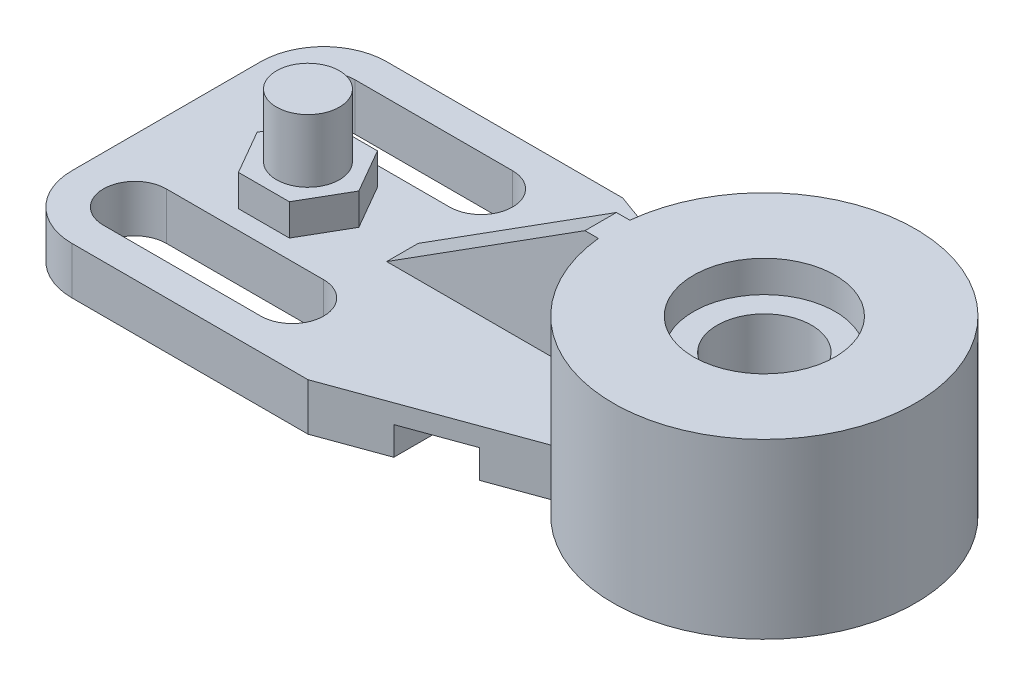
ISO-10303-21;
HEADER;
FILE_DESCRIPTION(('STEP AP214'),'2;1');
FILE_NAME('part.step','',(''),(''),'','','');
FILE_SCHEMA(('AUTOMOTIVE_DESIGN { 1 0 10303 214 1 1 1 1 }'));
ENDSEC;
DATA;
#1=APPLICATION_CONTEXT('core data for automotive mechanical design processes');
#2=APPLICATION_PROTOCOL_DEFINITION('international standard','automotive_design',2000,#1);
#3=PRODUCT_CONTEXT('',#1,'mechanical');
#4=PRODUCT('Part','Part','',(#3));
#5=PRODUCT_RELATED_PRODUCT_CATEGORY('part','',(#4));
#6=PRODUCT_DEFINITION_FORMATION('','',#4);
#7=PRODUCT_DEFINITION_CONTEXT('part definition',#1,'design');
#8=PRODUCT_DEFINITION('design','',#6,#7);
#9=PRODUCT_DEFINITION_SHAPE('','',#8);
#10=(LENGTH_UNIT() NAMED_UNIT(*) SI_UNIT(.MILLI.,.METRE.));
#11=(NAMED_UNIT(*) PLANE_ANGLE_UNIT() SI_UNIT($,.RADIAN.));
#12=(NAMED_UNIT(*) SI_UNIT($,.STERADIAN.) SOLID_ANGLE_UNIT());
#13=UNCERTAINTY_MEASURE_WITH_UNIT(LENGTH_MEASURE(1.E-05),#10,'distance_accuracy_value','');
#14=(GEOMETRIC_REPRESENTATION_CONTEXT(3) GLOBAL_UNCERTAINTY_ASSIGNED_CONTEXT((#13)) GLOBAL_UNIT_ASSIGNED_CONTEXT((#10,
#11,#12)) REPRESENTATION_CONTEXT('',''));
#15=CARTESIAN_POINT('',(0.,0.,0.));
#16=DIRECTION('',(0.,0.,1.));
#17=DIRECTION('',(1.,0.,0.));
#18=AXIS2_PLACEMENT_3D('',#15,#16,#17);
#19=CARTESIAN_POINT('',(0.,9.525,31.75));
#20=DIRECTION('',(0.,-1.,0.));
#21=DIRECTION('',(1.,0.,0.));
#22=AXIS2_PLACEMENT_3D('',#19,#20,#21);
#23=PLANE('',#22);
#24=DIRECTION('',(1.,0.,0.));
#25=VECTOR('',#24,1.);
#26=CARTESIAN_POINT('',(-107.95,9.52499999999999,25.4));
#27=LINE('',#26,#25);
#28=CARTESIAN_POINT('',(-107.95,9.52499999999999,25.4));
#29=VERTEX_POINT('',#28);
#30=CARTESIAN_POINT('',(-76.2,9.52499999999999,25.4));
#31=VERTEX_POINT('',#30);
#32=EDGE_CURVE('E382',#29,#31,#27,.T.);
#33=ORIENTED_EDGE('',*,*,#32,.F.);
#34=CARTESIAN_POINT('',(-107.95,9.52499999999999,19.05));
#35=DIRECTION('',(0.,1.,0.));
#36=DIRECTION('',(1.,0.,0.));
#37=AXIS2_PLACEMENT_3D('',#34,#35,#36);
#38=CIRCLE('',#37,6.35);
#39=CARTESIAN_POINT('',(-107.95,9.52499999999999,12.7));
#40=VERTEX_POINT('',#39);
#41=EDGE_CURVE('E349',#40,#29,#38,.T.);
#42=ORIENTED_EDGE('',*,*,#41,.F.);
#43=DIRECTION('',(-1.,0.,0.));
#44=VECTOR('',#43,1.);
#45=CARTESIAN_POINT('',(-107.95,9.52499999999999,12.7));
#46=LINE('',#45,#44);
#47=CARTESIAN_POINT('',(-76.2,9.52499999999999,12.7));
#48=VERTEX_POINT('',#47);
#49=EDGE_CURVE('E371',#48,#40,#46,.T.);
#50=ORIENTED_EDGE('',*,*,#49,.F.);
#51=CARTESIAN_POINT('',(-76.2,9.52499999999999,19.05));
#52=DIRECTION('',(0.,1.,0.));
#53=DIRECTION('',(1.,0.,0.));
#54=AXIS2_PLACEMENT_3D('',#51,#52,#53);
#55=CIRCLE('',#54,6.35);
#56=EDGE_CURVE('E379',#31,#48,#55,.T.);
#57=ORIENTED_EDGE('',*,*,#56,.F.);
#58=EDGE_LOOP('',(#33,#42,#50,#57));
#59=FACE_BOUND('',#58,.T.);
#60=DIRECTION('',(1.,0.,0.));
#61=VECTOR('',#60,1.);
#62=CARTESIAN_POINT('',(-107.95,9.52499999999999,-12.7));
#63=LINE('',#62,#61);
#64=CARTESIAN_POINT('',(-107.95,9.52499999999999,-12.7));
#65=VERTEX_POINT('',#64);
#66=CARTESIAN_POINT('',(-76.2,9.52499999999999,-12.7));
#67=VERTEX_POINT('',#66);
#68=EDGE_CURVE('E348',#65,#67,#63,.T.);
#69=ORIENTED_EDGE('',*,*,#68,.F.);
#70=CARTESIAN_POINT('',(-107.95,9.52499999999999,-19.05));
#71=DIRECTION('',(0.,1.,0.));
#72=DIRECTION('',(-1.,0.,0.));
#73=AXIS2_PLACEMENT_3D('',#70,#71,#72);
#74=CIRCLE('',#73,6.35);
#75=CARTESIAN_POINT('',(-107.95,9.52499999999999,-25.4));
#76=VERTEX_POINT('',#75);
#77=EDGE_CURVE('E346',#76,#65,#74,.T.);
#78=ORIENTED_EDGE('',*,*,#77,.F.);
#79=DIRECTION('',(-1.,0.,0.));
#80=VECTOR('',#79,1.);
#81=CARTESIAN_POINT('',(-107.95,9.52499999999999,-25.4));
#82=LINE('',#81,#80);
#83=CARTESIAN_POINT('',(-76.2,9.52499999999999,-25.4));
#84=VERTEX_POINT('',#83);
#85=EDGE_CURVE('E355',#84,#76,#82,.T.);
#86=ORIENTED_EDGE('',*,*,#85,.F.);
#87=CARTESIAN_POINT('',(-76.2,9.52499999999999,-19.05));
#88=DIRECTION('',(0.,1.,0.));
#89=DIRECTION('',(-1.,0.,0.));
#90=AXIS2_PLACEMENT_3D('',#87,#88,#89);
#91=CIRCLE('',#90,6.35);
#92=EDGE_CURVE('E352',#67,#84,#91,.T.);
#93=ORIENTED_EDGE('',*,*,#92,.F.);
#94=EDGE_LOOP('',(#69,#78,#86,#93));
#95=FACE_BOUND('',#94,.T.);
#96=CARTESIAN_POINT('',(0.,9.525,0.));
#97=DIRECTION('',(0.,-1.,0.));
#98=DIRECTION('',(1.,0.,0.));
#99=AXIS2_PLACEMENT_3D('',#96,#97,#98);
#100=CIRCLE('',#99,30.48);
#101=CARTESIAN_POINT('',(-30.3141843861912,9.525,3.175));
#102=VERTEX_POINT('',#101);
#103=CARTESIAN_POINT('',(-24.1575361709896,9.525,18.5861197173409));
#104=VERTEX_POINT('',#103);
#105=EDGE_CURVE('E456',#102,#104,#100,.F.);
#106=ORIENTED_EDGE('',*,*,#105,.F.);
#107=DIRECTION('',(1.,0.,0.));
#108=VECTOR('',#107,1.);
#109=CARTESIAN_POINT('',(-28.575,9.52499999999999,3.175));
#110=LINE('',#109,#108);
#111=CARTESIAN_POINT('',(-73.025,9.52499999999999,3.175));
#112=VERTEX_POINT('',#111);
#113=EDGE_CURVE('E268',#112,#102,#110,.T.);
#114=ORIENTED_EDGE('',*,*,#113,.F.);
#115=DIRECTION('',(0.,0.,-1.));
#116=VECTOR('',#115,1.);
#117=CARTESIAN_POINT('',(-73.025,9.52499999999999,3.175));
#118=LINE('',#117,#116);
#119=CARTESIAN_POINT('',(-73.025,9.52499999999999,-3.175));
#120=VERTEX_POINT('',#119);
#121=EDGE_CURVE('E276',#112,#120,#118,.T.);
#122=ORIENTED_EDGE('',*,*,#121,.T.);
#123=DIRECTION('',(1.,0.,0.));
#124=VECTOR('',#123,1.);
#125=CARTESIAN_POINT('',(-28.575,9.52499999999999,-3.175));
#126=LINE('',#125,#124);
#127=CARTESIAN_POINT('',(-30.3141843861912,9.52499999999999,-3.175));
#128=VERTEX_POINT('',#127);
#129=EDGE_CURVE('E259',#120,#128,#126,.T.);
#130=ORIENTED_EDGE('',*,*,#129,.T.);
#131=CARTESIAN_POINT('',(-24.1575361709896,9.525,-18.5861197173409));
#132=VERTEX_POINT('',#131);
#133=EDGE_CURVE('E48',#132,#128,#100,.F.);
#134=ORIENTED_EDGE('',*,*,#133,.F.);
#135=DIRECTION('',(0.939692620785911,0.,0.342020143325663));
#136=VECTOR('',#135,1.);
#137=CARTESIAN_POINT('',(-60.325,9.52499999999999,-31.75));
#138=LINE('',#137,#136);
#139=CARTESIAN_POINT('',(-60.325,9.52499999999999,-31.75));
#140=VERTEX_POINT('',#139);
#141=EDGE_CURVE('E296',#140,#132,#138,.T.);
#142=ORIENTED_EDGE('',*,*,#141,.F.);
#143=DIRECTION('',(-1.,0.,0.));
#144=VECTOR('',#143,1.);
#145=CARTESIAN_POINT('',(0.,9.525,-31.75));
#146=LINE('',#145,#144);
#147=CARTESIAN_POINT('',(-107.95,9.52499999999999,-31.75));
#148=VERTEX_POINT('',#147);
#149=EDGE_CURVE('E361',#140,#148,#146,.T.);
#150=ORIENTED_EDGE('',*,*,#149,.T.);
#151=CARTESIAN_POINT('',(-107.95,9.52499999999999,-19.05));
#152=DIRECTION('',(0.,-1.,0.));
#153=DIRECTION('',(1.,0.,0.));
#154=AXIS2_PLACEMENT_3D('',#151,#152,#153);
#155=CIRCLE('',#154,12.7);
#156=CARTESIAN_POINT('',(-120.65,9.52499999999998,-19.05));
#157=VERTEX_POINT('',#156);
#158=EDGE_CURVE('E428',#148,#157,#155,.F.);
#159=ORIENTED_EDGE('',*,*,#158,.T.);
#160=DIRECTION('',(0.,0.,-1.));
#161=VECTOR('',#160,1.);
#162=CARTESIAN_POINT('',(-120.65,9.52499999999998,31.75));
#163=LINE('',#162,#161);
#164=CARTESIAN_POINT('',(-120.65,9.52499999999998,19.05));
#165=VERTEX_POINT('',#164);
#166=EDGE_CURVE('E410',#165,#157,#163,.T.);
#167=ORIENTED_EDGE('',*,*,#166,.F.);
#168=CARTESIAN_POINT('',(-107.95,9.52499999999999,19.05));
#169=DIRECTION('',(0.,-1.,0.));
#170=DIRECTION('',(1.,0.,0.));
#171=AXIS2_PLACEMENT_3D('',#168,#169,#170);
#172=CIRCLE('',#171,12.7);
#173=CARTESIAN_POINT('',(-107.95,9.52499999999999,31.75));
#174=VERTEX_POINT('',#173);
#175=EDGE_CURVE('E425',#165,#174,#172,.F.);
#176=ORIENTED_EDGE('',*,*,#175,.T.);
#177=DIRECTION('',(-1.,0.,0.));
#178=VECTOR('',#177,1.);
#179=CARTESIAN_POINT('',(0.,9.525,31.75));
#180=LINE('',#179,#178);
#181=CARTESIAN_POINT('',(-60.325,9.52499999999999,31.75));
#182=VERTEX_POINT('',#181);
#183=EDGE_CURVE('E386',#182,#174,#180,.T.);
#184=ORIENTED_EDGE('',*,*,#183,.F.);
#185=DIRECTION('',(-0.939692620785911,0.,0.342020143325663));
#186=VECTOR('',#185,1.);
#187=CARTESIAN_POINT('',(-60.325,9.52499999999999,31.75));
#188=LINE('',#187,#186);
#189=EDGE_CURVE('E298',#104,#182,#188,.T.);
#190=ORIENTED_EDGE('',*,*,#189,.F.);
#191=EDGE_LOOP('',(#106,#114,#122,#130,#134,#142,#150,#159,#167,#176,#184,#190));
#192=FACE_BOUND('',#191,.T.);
#193=DIRECTION('',(0.5,0.,-0.866025403784438));
#194=VECTOR('',#193,1.);
#195=CARTESIAN_POINT('',(-86.9423561069042,9.52499999999999,8.89));
#196=LINE('',#195,#194);
#197=CARTESIAN_POINT('',(-86.9423561069042,9.52499999999999,8.89));
#198=VERTEX_POINT('',#197);
#199=CARTESIAN_POINT('',(-81.8097122138085,9.52499999999999,0.));
#200=VERTEX_POINT('',#199);
#201=EDGE_CURVE('E258',#198,#200,#196,.T.);
#202=ORIENTED_EDGE('',*,*,#201,.F.);
#203=DIRECTION('',(1.,0.,0.));
#204=VECTOR('',#203,1.);
#205=CARTESIAN_POINT('',(-97.2076438930958,9.52499999999999,8.89));
#206=LINE('',#205,#204);
#207=CARTESIAN_POINT('',(-97.2076438930958,9.52499999999999,8.89));
#208=VERTEX_POINT('',#207);
#209=EDGE_CURVE('E255',#208,#198,#206,.T.);
#210=ORIENTED_EDGE('',*,*,#209,.F.);
#211=DIRECTION('',(0.5,0.,0.866025403784439));
#212=VECTOR('',#211,1.);
#213=CARTESIAN_POINT('',(-102.340287786192,9.52499999999999,0.));
#214=LINE('',#213,#212);
#215=CARTESIAN_POINT('',(-102.340287786192,9.52499999999999,0.));
#216=VERTEX_POINT('',#215);
#217=EDGE_CURVE('E805',#216,#208,#214,.T.);
#218=ORIENTED_EDGE('',*,*,#217,.F.);
#219=DIRECTION('',(-0.5,0.,0.866025403784439));
#220=VECTOR('',#219,1.);
#221=CARTESIAN_POINT('',(-97.2076438930958,9.52499999999999,-8.89));
#222=LINE('',#221,#220);
#223=CARTESIAN_POINT('',(-97.2076438930958,9.52499999999999,-8.89));
#224=VERTEX_POINT('',#223);
#225=EDGE_CURVE('E802',#224,#216,#222,.T.);
#226=ORIENTED_EDGE('',*,*,#225,.F.);
#227=DIRECTION('',(-1.,0.,0.));
#228=VECTOR('',#227,1.);
#229=CARTESIAN_POINT('',(-86.9423561069042,9.52499999999999,-8.89));
#230=LINE('',#229,#228);
#231=CARTESIAN_POINT('',(-86.9423561069042,9.52499999999999,-8.88999999999999));
#232=VERTEX_POINT('',#231);
#233=EDGE_CURVE('E61',#232,#224,#230,.T.);
#234=ORIENTED_EDGE('',*,*,#233,.F.);
#235=DIRECTION('',(-0.5,0.,-0.866025403784438));
#236=VECTOR('',#235,1.);
#237=CARTESIAN_POINT('',(-81.8097122138085,9.52499999999999,0.));
#238=LINE('',#237,#236);
#239=EDGE_CURVE('E56',#200,#232,#238,.T.);
#240=ORIENTED_EDGE('',*,*,#239,.F.);
#241=EDGE_LOOP('',(#202,#210,#218,#226,#234,#240));
#242=FACE_BOUND('',#241,.T.);
#243=ADVANCED_FACE('F39',(#59,#95,#192,#242),#23,.F.);
#244=CARTESIAN_POINT('',(0.,0.,0.));
#245=DIRECTION('',(0.,1.,0.));
#246=DIRECTION('',(0.,0.,1.));
#247=AXIS2_PLACEMENT_3D('',#244,#245,#246);
#248=CYLINDRICAL_SURFACE('',#247,9.525);
#249=CARTESIAN_POINT('',(0.,0.,0.));
#250=DIRECTION('',(0.,1.,0.));
#251=DIRECTION('',(0.,0.,1.));
#252=AXIS2_PLACEMENT_3D('',#249,#250,#251);
#253=CIRCLE('',#252,9.525);
#254=CARTESIAN_POINT('',(0.,0.,9.525));
#255=VERTEX_POINT('',#254);
#256=EDGE_CURVE('E337',#255,#255,#253,.T.);
#257=ORIENTED_EDGE('',*,*,#256,.F.);
#258=EDGE_LOOP('',(#257));
#259=FACE_BOUND('',#258,.T.);
#260=CARTESIAN_POINT('',(0.,28.575,0.));
#261=DIRECTION('',(0.,1.,0.));
#262=DIRECTION('',(0.,0.,1.));
#263=AXIS2_PLACEMENT_3D('',#260,#261,#262);
#264=CIRCLE('',#263,9.525);
#265=CARTESIAN_POINT('',(0.,28.575,9.525));
#266=VERTEX_POINT('',#265);
#267=EDGE_CURVE('E43',#266,#266,#264,.F.);
#268=ORIENTED_EDGE('',*,*,#267,.F.);
#269=EDGE_LOOP('',(#268));
#270=FACE_BOUND('',#269,.T.);
#271=ADVANCED_FACE('F520',(#259,#270),#248,.F.);
#272=CARTESIAN_POINT('',(-34.925,0.,31.75));
#273=DIRECTION('',(0.,1.,0.));
#274=DIRECTION('',(0.,0.,1.));
#275=AXIS2_PLACEMENT_3D('',#272,#273,#274);
#276=PLANE('',#275);
#277=ORIENTED_EDGE('',*,*,#256,.T.);
#278=EDGE_LOOP('',(#277));
#279=FACE_BOUND('',#278,.T.);
#280=DIRECTION('',(0.939692620785911,0.,0.342020143325663));
#281=VECTOR('',#280,1.);
#282=CARTESIAN_POINT('',(-60.325,0.,-31.75));
#283=LINE('',#282,#281);
#284=CARTESIAN_POINT('',(-34.925,0.,-22.5051560496386));
#285=VERTEX_POINT('',#284);
#286=CARTESIAN_POINT('',(-24.1575361709896,0.,-18.5861197173409));
#287=VERTEX_POINT('',#286);
#288=EDGE_CURVE('E295',#285,#287,#283,.T.);
#289=ORIENTED_EDGE('',*,*,#288,.T.);
#290=CARTESIAN_POINT('',(0.,0.,0.));
#291=DIRECTION('',(0.,1.,0.));
#292=DIRECTION('',(0.,0.,1.));
#293=AXIS2_PLACEMENT_3D('',#290,#291,#292);
#294=CIRCLE('',#293,30.48);
#295=CARTESIAN_POINT('',(-24.1575361709896,0.,18.5861197173409));
#296=VERTEX_POINT('',#295);
#297=EDGE_CURVE('E340',#296,#287,#294,.T.);
#298=ORIENTED_EDGE('',*,*,#297,.F.);
#299=DIRECTION('',(-0.939692620785911,0.,0.342020143325663));
#300=VECTOR('',#299,1.);
#301=CARTESIAN_POINT('',(-60.325,0.,31.75));
#302=LINE('',#301,#300);
#303=CARTESIAN_POINT('',(-34.925,0.,22.5051560496386));
#304=VERTEX_POINT('',#303);
#305=EDGE_CURVE('E311',#296,#304,#302,.T.);
#306=ORIENTED_EDGE('',*,*,#305,.T.);
#307=DIRECTION('',(0.,0.,-1.));
#308=VECTOR('',#307,1.);
#309=CARTESIAN_POINT('',(-34.925,0.,31.75));
#310=LINE('',#309,#308);
#311=EDGE_CURVE('E392',#304,#285,#310,.T.);
#312=ORIENTED_EDGE('',*,*,#311,.T.);
#313=EDGE_LOOP('',(#289,#298,#306,#312));
#314=FACE_BOUND('',#313,.T.);
#315=ADVANCED_FACE('F490',(#279,#314),#276,.F.);
#316=CARTESIAN_POINT('',(-120.65,9.52499999999998,31.75));
#317=DIRECTION('',(1.,0.,0.));
#318=DIRECTION('',(0.,1.,0.));
#319=AXIS2_PLACEMENT_3D('',#316,#317,#318);
#320=PLANE('',#319);
#321=ORIENTED_EDGE('',*,*,#166,.T.);
#322=DIRECTION('',(0.,-1.,0.));
#323=VECTOR('',#322,1.);
#324=CARTESIAN_POINT('',(-120.65,9.52499999999998,-19.05));
#325=LINE('',#324,#323);
#326=CARTESIAN_POINT('',(-120.65,0.,-19.05));
#327=VERTEX_POINT('',#326);
#328=EDGE_CURVE('E415',#157,#327,#325,.T.);
#329=ORIENTED_EDGE('',*,*,#328,.T.);
#330=DIRECTION('',(0.,0.,-1.));
#331=VECTOR('',#330,1.);
#332=CARTESIAN_POINT('',(-120.65,0.,31.75));
#333=LINE('',#332,#331);
#334=CARTESIAN_POINT('',(-120.65,0.,19.05));
#335=VERTEX_POINT('',#334);
#336=EDGE_CURVE('E407',#335,#327,#333,.T.);
#337=ORIENTED_EDGE('',*,*,#336,.F.);
#338=DIRECTION('',(0.,-1.,0.));
#339=VECTOR('',#338,1.);
#340=CARTESIAN_POINT('',(-120.65,9.52499999999998,19.05));
#341=LINE('',#340,#339);
#342=EDGE_CURVE('E413',#335,#165,#341,.F.);
#343=ORIENTED_EDGE('',*,*,#342,.T.);
#344=EDGE_LOOP('',(#321,#329,#337,#343));
#345=FACE_BOUND('',#344,.T.);
#346=ADVANCED_FACE('F506',(#345),#320,.F.);
#347=CARTESIAN_POINT('',(-120.65,0.,31.75));
#348=DIRECTION('',(0.,1.,0.));
#349=DIRECTION('',(-1.,0.,0.));
#350=AXIS2_PLACEMENT_3D('',#347,#348,#349);
#351=PLANE('',#350);
#352=DIRECTION('',(-1.,0.,0.));
#353=VECTOR('',#352,1.);
#354=CARTESIAN_POINT('',(-120.65,0.,-25.4));
#355=LINE('',#354,#353);
#356=CARTESIAN_POINT('',(-76.2,0.,-25.4));
#357=VERTEX_POINT('',#356);
#358=CARTESIAN_POINT('',(-107.95,0.,-25.4));
#359=VERTEX_POINT('',#358);
#360=EDGE_CURVE('E451',#357,#359,#355,.T.);
#361=ORIENTED_EDGE('',*,*,#360,.T.);
#362=CARTESIAN_POINT('',(-107.95,0.,-19.05));
#363=DIRECTION('',(0.,1.,0.));
#364=DIRECTION('',(-1.,0.,0.));
#365=AXIS2_PLACEMENT_3D('',#362,#363,#364);
#366=CIRCLE('',#365,6.35);
#367=CARTESIAN_POINT('',(-107.95,0.,-12.7));
#368=VERTEX_POINT('',#367);
#369=EDGE_CURVE('E454',#359,#368,#366,.T.);
#370=ORIENTED_EDGE('',*,*,#369,.T.);
#371=DIRECTION('',(1.,0.,0.));
#372=VECTOR('',#371,1.);
#373=CARTESIAN_POINT('',(-120.65,0.,-12.7));
#374=LINE('',#373,#372);
#375=CARTESIAN_POINT('',(-76.2,0.,-12.7));
#376=VERTEX_POINT('',#375);
#377=EDGE_CURVE('E445',#368,#376,#374,.T.);
#378=ORIENTED_EDGE('',*,*,#377,.T.);
#379=CARTESIAN_POINT('',(-76.2,0.,-19.05));
#380=DIRECTION('',(0.,1.,0.));
#381=DIRECTION('',(-1.,0.,0.));
#382=AXIS2_PLACEMENT_3D('',#379,#380,#381);
#383=CIRCLE('',#382,6.35);
#384=EDGE_CURVE('E448',#376,#357,#383,.T.);
#385=ORIENTED_EDGE('',*,*,#384,.T.);
#386=EDGE_LOOP('',(#361,#370,#378,#385));
#387=FACE_BOUND('',#386,.T.);
#388=DIRECTION('',(-1.,0.,0.));
#389=VECTOR('',#388,1.);
#390=CARTESIAN_POINT('',(-120.65,0.,12.7));
#391=LINE('',#390,#389);
#392=CARTESIAN_POINT('',(-76.2,0.,12.7));
#393=VERTEX_POINT('',#392);
#394=CARTESIAN_POINT('',(-107.95,0.,12.7));
#395=VERTEX_POINT('',#394);
#396=EDGE_CURVE('E439',#393,#395,#391,.T.);
#397=ORIENTED_EDGE('',*,*,#396,.T.);
#398=CARTESIAN_POINT('',(-107.95,0.,19.05));
#399=DIRECTION('',(0.,1.,0.));
#400=DIRECTION('',(-1.,0.,0.));
#401=AXIS2_PLACEMENT_3D('',#398,#399,#400);
#402=CIRCLE('',#401,6.35);
#403=CARTESIAN_POINT('',(-107.95,0.,25.4));
#404=VERTEX_POINT('',#403);
#405=EDGE_CURVE('E442',#395,#404,#402,.T.);
#406=ORIENTED_EDGE('',*,*,#405,.T.);
#407=DIRECTION('',(1.,0.,0.));
#408=VECTOR('',#407,1.);
#409=CARTESIAN_POINT('',(-120.65,0.,25.4));
#410=LINE('',#409,#408);
#411=CARTESIAN_POINT('',(-76.2,0.,25.4));
#412=VERTEX_POINT('',#411);
#413=EDGE_CURVE('E433',#404,#412,#410,.T.);
#414=ORIENTED_EDGE('',*,*,#413,.T.);
#415=CARTESIAN_POINT('',(-76.2,0.,19.05));
#416=DIRECTION('',(0.,1.,0.));
#417=DIRECTION('',(-1.,0.,0.));
#418=AXIS2_PLACEMENT_3D('',#415,#416,#417);
#419=CIRCLE('',#418,6.35);
#420=EDGE_CURVE('E436',#412,#393,#419,.T.);
#421=ORIENTED_EDGE('',*,*,#420,.T.);
#422=EDGE_LOOP('',(#397,#406,#414,#421));
#423=FACE_BOUND('',#422,.T.);
#424=DIRECTION('',(1.,0.,0.));
#425=VECTOR('',#424,1.);
#426=CARTESIAN_POINT('',(-120.65,0.,-31.75));
#427=LINE('',#426,#425);
#428=CARTESIAN_POINT('',(-107.95,0.,-31.75));
#429=VERTEX_POINT('',#428);
#430=CARTESIAN_POINT('',(-60.325,0.,-31.75));
#431=VERTEX_POINT('',#430);
#432=EDGE_CURVE('E389',#429,#431,#427,.T.);
#433=ORIENTED_EDGE('',*,*,#432,.T.);
#434=CARTESIAN_POINT('',(-47.625,0.,-27.1275780248193));
#435=VERTEX_POINT('',#434);
#436=EDGE_CURVE('E291',#431,#435,#283,.T.);
#437=ORIENTED_EDGE('',*,*,#436,.T.);
#438=DIRECTION('',(0.,0.,-1.));
#439=VECTOR('',#438,1.);
#440=CARTESIAN_POINT('',(-47.625,0.,31.75));
#441=LINE('',#440,#439);
#442=CARTESIAN_POINT('',(-47.625,0.,27.1275780248193));
#443=VERTEX_POINT('',#442);
#444=EDGE_CURVE('E404',#443,#435,#441,.T.);
#445=ORIENTED_EDGE('',*,*,#444,.F.);
#446=CARTESIAN_POINT('',(-60.325,0.,31.75));
#447=VERTEX_POINT('',#446);
#448=EDGE_CURVE('E307',#443,#447,#302,.T.);
#449=ORIENTED_EDGE('',*,*,#448,.T.);
#450=DIRECTION('',(1.,0.,0.));
#451=VECTOR('',#450,1.);
#452=CARTESIAN_POINT('',(-120.65,0.,31.75));
#453=LINE('',#452,#451);
#454=CARTESIAN_POINT('',(-107.95,0.,31.75));
#455=VERTEX_POINT('',#454);
#456=EDGE_CURVE('E388',#455,#447,#453,.T.);
#457=ORIENTED_EDGE('',*,*,#456,.F.);
#458=CARTESIAN_POINT('',(-107.95,0.,19.05));
#459=DIRECTION('',(0.,1.,0.));
#460=DIRECTION('',(-1.,0.,0.));
#461=AXIS2_PLACEMENT_3D('',#458,#459,#460);
#462=CIRCLE('',#461,12.7);
#463=EDGE_CURVE('E418',#455,#335,#462,.F.);
#464=ORIENTED_EDGE('',*,*,#463,.T.);
#465=ORIENTED_EDGE('',*,*,#336,.T.);
#466=CARTESIAN_POINT('',(-107.95,0.,-19.05));
#467=DIRECTION('',(0.,1.,0.));
#468=DIRECTION('',(-1.,0.,0.));
#469=AXIS2_PLACEMENT_3D('',#466,#467,#468);
#470=CIRCLE('',#469,12.7);
#471=EDGE_CURVE('E420',#327,#429,#470,.F.);
#472=ORIENTED_EDGE('',*,*,#471,.T.);
#473=EDGE_LOOP('',(#433,#437,#445,#449,#457,#464,#465,#472));
#474=FACE_BOUND('',#473,.T.);
#475=ADVANCED_FACE('F478',(#387,#423,#474),#351,.F.);
#476=CARTESIAN_POINT('',(-47.625,0.,31.75));
#477=DIRECTION('',(-1.,0.,0.));
#478=DIRECTION('',(0.,0.,1.));
#479=AXIS2_PLACEMENT_3D('',#476,#477,#478);
#480=PLANE('',#479);
#481=ORIENTED_EDGE('',*,*,#444,.T.);
#482=DIRECTION('',(0.,1.,0.));
#483=VECTOR('',#482,1.);
#484=CARTESIAN_POINT('',(-47.625,0.,-27.1275780248193));
#485=LINE('',#484,#483);
#486=CARTESIAN_POINT('',(-47.625,5.715,-27.1275780248193));
#487=VERTEX_POINT('',#486);
#488=EDGE_CURVE('E328',#435,#487,#485,.T.);
#489=ORIENTED_EDGE('',*,*,#488,.T.);
#490=DIRECTION('',(0.,0.,-1.));
#491=VECTOR('',#490,1.);
#492=CARTESIAN_POINT('',(-47.625,5.715,31.75));
#493=LINE('',#492,#491);
#494=CARTESIAN_POINT('',(-47.625,5.715,27.1275780248193));
#495=VERTEX_POINT('',#494);
#496=EDGE_CURVE('E401',#495,#487,#493,.T.);
#497=ORIENTED_EDGE('',*,*,#496,.F.);
#498=DIRECTION('',(0.,-1.,0.));
#499=VECTOR('',#498,1.);
#500=CARTESIAN_POINT('',(-47.625,0.,27.1275780248193));
#501=LINE('',#500,#499);
#502=EDGE_CURVE('E319',#495,#443,#501,.T.);
#503=ORIENTED_EDGE('',*,*,#502,.T.);
#504=EDGE_LOOP('',(#481,#489,#497,#503));
#505=FACE_BOUND('',#504,.T.);
#506=ADVANCED_FACE('F480',(#505),#480,.F.);
#507=CARTESIAN_POINT('',(-47.625,5.715,31.75));
#508=DIRECTION('',(0.,1.,0.));
#509=DIRECTION('',(-1.,0.,0.));
#510=AXIS2_PLACEMENT_3D('',#507,#508,#509);
#511=PLANE('',#510);
#512=ORIENTED_EDGE('',*,*,#496,.T.);
#513=DIRECTION('',(0.939692620785911,0.,0.342020143325663));
#514=VECTOR('',#513,1.);
#515=CARTESIAN_POINT('',(-28.7021111786471,5.715,-20.2402097475183));
#516=LINE('',#515,#514);
#517=CARTESIAN_POINT('',(-34.925,5.715,-22.5051560496386));
#518=VERTEX_POINT('',#517);
#519=EDGE_CURVE('E325',#487,#518,#516,.T.);
#520=ORIENTED_EDGE('',*,*,#519,.T.);
#521=DIRECTION('',(0.,0.,-1.));
#522=VECTOR('',#521,1.);
#523=CARTESIAN_POINT('',(-34.925,5.715,31.75));
#524=LINE('',#523,#522);
#525=CARTESIAN_POINT('',(-34.925,5.715,22.5051560496386));
#526=VERTEX_POINT('',#525);
#527=EDGE_CURVE('E398',#526,#518,#524,.T.);
#528=ORIENTED_EDGE('',*,*,#527,.F.);
#529=DIRECTION('',(-0.939692620785911,0.,0.342020143325663));
#530=VECTOR('',#529,1.);
#531=CARTESIAN_POINT('',(-49.1106177861944,5.715,27.6682986784905));
#532=LINE('',#531,#530);
#533=EDGE_CURVE('E316',#526,#495,#532,.T.);
#534=ORIENTED_EDGE('',*,*,#533,.T.);
#535=EDGE_LOOP('',(#512,#520,#528,#534));
#536=FACE_BOUND('',#535,.T.);
#537=ADVANCED_FACE('F484',(#536),#511,.F.);
#538=CARTESIAN_POINT('',(-34.925,5.715,31.75));
#539=DIRECTION('',(1.,0.,0.));
#540=DIRECTION('',(0.,0.,-1.));
#541=AXIS2_PLACEMENT_3D('',#538,#539,#540);
#542=PLANE('',#541);
#543=ORIENTED_EDGE('',*,*,#527,.T.);
#544=DIRECTION('',(0.,-1.,0.));
#545=VECTOR('',#544,1.);
#546=CARTESIAN_POINT('',(-34.925,5.715,-22.5051560496386));
#547=LINE('',#546,#545);
#548=EDGE_CURVE('E322',#518,#285,#547,.T.);
#549=ORIENTED_EDGE('',*,*,#548,.T.);
#550=ORIENTED_EDGE('',*,*,#311,.F.);
#551=DIRECTION('',(0.,1.,0.));
#552=VECTOR('',#551,1.);
#553=CARTESIAN_POINT('',(-34.925,5.715,22.5051560496386));
#554=LINE('',#553,#552);
#555=EDGE_CURVE('E302',#304,#526,#554,.T.);
#556=ORIENTED_EDGE('',*,*,#555,.T.);
#557=EDGE_LOOP('',(#543,#549,#550,#556));
#558=FACE_BOUND('',#557,.T.);
#559=ADVANCED_FACE('F486',(#558),#542,.F.);
#560=CARTESIAN_POINT('',(0.,0.,31.75));
#561=DIRECTION('',(0.,0.,1.));
#562=DIRECTION('',(1.,0.,0.));
#563=AXIS2_PLACEMENT_3D('',#560,#561,#562);
#564=PLANE('',#563);
#565=DIRECTION('',(0.,1.,0.));
#566=VECTOR('',#565,1.);
#567=CARTESIAN_POINT('',(-60.325,0.,31.75));
#568=LINE('',#567,#566);
#569=EDGE_CURVE('E290',#447,#182,#568,.T.);
#570=ORIENTED_EDGE('',*,*,#569,.T.);
#571=ORIENTED_EDGE('',*,*,#183,.T.);
#572=DIRECTION('',(0.,-1.,0.));
#573=VECTOR('',#572,1.);
#574=CARTESIAN_POINT('',(-107.95,0.,31.75));
#575=LINE('',#574,#573);
#576=EDGE_CURVE('E430',#174,#455,#575,.T.);
#577=ORIENTED_EDGE('',*,*,#576,.T.);
#578=ORIENTED_EDGE('',*,*,#456,.T.);
#579=EDGE_LOOP('',(#570,#571,#577,#578));
#580=FACE_BOUND('',#579,.T.);
#581=ADVANCED_FACE('F473',(#580),#564,.T.);
#582=CARTESIAN_POINT('',(0.,0.,-31.75));
#583=DIRECTION('',(0.,0.,1.));
#584=DIRECTION('',(1.,0.,0.));
#585=AXIS2_PLACEMENT_3D('',#582,#583,#584);
#586=PLANE('',#585);
#587=ORIENTED_EDGE('',*,*,#149,.F.);
#588=DIRECTION('',(0.,1.,0.));
#589=VECTOR('',#588,1.);
#590=CARTESIAN_POINT('',(-60.325,0.,-31.75));
#591=LINE('',#590,#589);
#592=EDGE_CURVE('E294',#431,#140,#591,.T.);
#593=ORIENTED_EDGE('',*,*,#592,.F.);
#594=ORIENTED_EDGE('',*,*,#432,.F.);
#595=DIRECTION('',(0.,-1.,0.));
#596=VECTOR('',#595,1.);
#597=CARTESIAN_POINT('',(-107.95,-1.57281595155231E-13,-31.75));
#598=LINE('',#597,#596);
#599=EDGE_CURVE('E422',#429,#148,#598,.F.);
#600=ORIENTED_EDGE('',*,*,#599,.T.);
#601=EDGE_LOOP('',(#587,#593,#594,#600));
#602=FACE_BOUND('',#601,.T.);
#603=ADVANCED_FACE('F498',(#602),#586,.F.);
#604=CARTESIAN_POINT('',(-107.95,9.525,-19.05));
#605=DIRECTION('',(0.,-1.,0.));
#606=DIRECTION('',(1.,0.,0.));
#607=AXIS2_PLACEMENT_3D('',#604,#605,#606);
#608=CYLINDRICAL_SURFACE('',#607,12.7);
#609=ORIENTED_EDGE('',*,*,#158,.F.);
#610=ORIENTED_EDGE('',*,*,#599,.F.);
#611=ORIENTED_EDGE('',*,*,#471,.F.);
#612=ORIENTED_EDGE('',*,*,#328,.F.);
#613=EDGE_LOOP('',(#609,#610,#611,#612));
#614=FACE_BOUND('',#613,.T.);
#615=ADVANCED_FACE('F504',(#614),#608,.T.);
#616=CARTESIAN_POINT('',(-107.95,-1.57281595155231E-13,19.05));
#617=DIRECTION('',(0.,1.,0.));
#618=DIRECTION('',(-1.,0.,0.));
#619=AXIS2_PLACEMENT_3D('',#616,#617,#618);
#620=CYLINDRICAL_SURFACE('',#619,12.7);
#621=ORIENTED_EDGE('',*,*,#175,.F.);
#622=ORIENTED_EDGE('',*,*,#342,.F.);
#623=ORIENTED_EDGE('',*,*,#463,.F.);
#624=ORIENTED_EDGE('',*,*,#576,.F.);
#625=EDGE_LOOP('',(#621,#622,#623,#624));
#626=FACE_BOUND('',#625,.T.);
#627=ADVANCED_FACE('F41',(#626),#620,.T.);
#628=CARTESIAN_POINT('',(-107.95,-53.975,19.05));
#629=DIRECTION('',(0.,1.,0.));
#630=DIRECTION('',(-1.,0.,0.));
#631=AXIS2_PLACEMENT_3D('',#628,#629,#630);
#632=CYLINDRICAL_SURFACE('',#631,6.35);
#633=DIRECTION('',(0.,1.,0.));
#634=VECTOR('',#633,1.);
#635=CARTESIAN_POINT('',(-107.95,-53.975,12.7));
#636=LINE('',#635,#634);
#637=EDGE_CURVE('E344',#395,#40,#636,.T.);
#638=ORIENTED_EDGE('',*,*,#637,.T.);
#639=ORIENTED_EDGE('',*,*,#41,.T.);
#640=DIRECTION('',(0.,1.,0.));
#641=VECTOR('',#640,1.);
#642=CARTESIAN_POINT('',(-107.95,-53.975,25.4));
#643=LINE('',#642,#641);
#644=EDGE_CURVE('E368',#404,#29,#643,.T.);
#645=ORIENTED_EDGE('',*,*,#644,.F.);
#646=ORIENTED_EDGE('',*,*,#405,.F.);
#647=EDGE_LOOP('',(#638,#639,#645,#646));
#648=FACE_BOUND('',#647,.T.);
#649=ADVANCED_FACE('F511',(#648),#632,.F.);
#650=CARTESIAN_POINT('',(-107.95,-53.975,12.7));
#651=DIRECTION('',(0.,0.,-1.));
#652=DIRECTION('',(-1.,0.,0.));
#653=AXIS2_PLACEMENT_3D('',#650,#651,#652);
#654=PLANE('',#653);
#655=DIRECTION('',(0.,1.,0.));
#656=VECTOR('',#655,1.);
#657=CARTESIAN_POINT('',(-76.2,-53.975,12.7));
#658=LINE('',#657,#656);
#659=EDGE_CURVE('E374',#393,#48,#658,.T.);
#660=ORIENTED_EDGE('',*,*,#659,.T.);
#661=ORIENTED_EDGE('',*,*,#49,.T.);
#662=ORIENTED_EDGE('',*,*,#637,.F.);
#663=ORIENTED_EDGE('',*,*,#396,.F.);
#664=EDGE_LOOP('',(#660,#661,#662,#663));
#665=FACE_BOUND('',#664,.T.);
#666=ADVANCED_FACE('F516',(#665),#654,.F.);
#667=CARTESIAN_POINT('',(-76.2,-53.975,19.05));
#668=DIRECTION('',(0.,1.,0.));
#669=DIRECTION('',(-1.,0.,0.));
#670=AXIS2_PLACEMENT_3D('',#667,#668,#669);
#671=CYLINDRICAL_SURFACE('',#670,6.35);
#672=DIRECTION('',(0.,1.,0.));
#673=VECTOR('',#672,1.);
#674=CARTESIAN_POINT('',(-76.2,-53.975,25.4));
#675=LINE('',#674,#673);
#676=EDGE_CURVE('E372',#412,#31,#675,.T.);
#677=ORIENTED_EDGE('',*,*,#676,.T.);
#678=ORIENTED_EDGE('',*,*,#56,.T.);
#679=ORIENTED_EDGE('',*,*,#659,.F.);
#680=ORIENTED_EDGE('',*,*,#420,.F.);
#681=EDGE_LOOP('',(#677,#678,#679,#680));
#682=FACE_BOUND('',#681,.T.);
#683=ADVANCED_FACE('F584',(#682),#671,.F.);
#684=CARTESIAN_POINT('',(-107.95,-53.975,25.4));
#685=DIRECTION('',(0.,0.,1.));
#686=DIRECTION('',(1.,0.,0.));
#687=AXIS2_PLACEMENT_3D('',#684,#685,#686);
#688=PLANE('',#687);
#689=ORIENTED_EDGE('',*,*,#644,.T.);
#690=ORIENTED_EDGE('',*,*,#32,.T.);
#691=ORIENTED_EDGE('',*,*,#676,.F.);
#692=ORIENTED_EDGE('',*,*,#413,.F.);
#693=EDGE_LOOP('',(#689,#690,#691,#692));
#694=FACE_BOUND('',#693,.T.);
#695=ADVANCED_FACE('F579',(#694),#688,.F.);
#696=CARTESIAN_POINT('',(-107.95,-53.975,-19.05));
#697=DIRECTION('',(0.,1.,0.));
#698=DIRECTION('',(-1.,0.,0.));
#699=AXIS2_PLACEMENT_3D('',#696,#697,#698);
#700=CYLINDRICAL_SURFACE('',#699,6.35);
#701=DIRECTION('',(0.,1.,0.));
#702=VECTOR('',#701,1.);
#703=CARTESIAN_POINT('',(-107.95,-53.975,-25.4));
#704=LINE('',#703,#702);
#705=EDGE_CURVE('E359',#359,#76,#704,.T.);
#706=ORIENTED_EDGE('',*,*,#705,.T.);
#707=ORIENTED_EDGE('',*,*,#77,.T.);
#708=DIRECTION('',(0.,1.,0.));
#709=VECTOR('',#708,1.);
#710=CARTESIAN_POINT('',(-107.95,-53.975,-12.7));
#711=LINE('',#710,#709);
#712=EDGE_CURVE('E358',#368,#65,#711,.T.);
#713=ORIENTED_EDGE('',*,*,#712,.F.);
#714=ORIENTED_EDGE('',*,*,#369,.F.);
#715=EDGE_LOOP('',(#706,#707,#713,#714));
#716=FACE_BOUND('',#715,.T.);
#717=ADVANCED_FACE('F570',(#716),#700,.F.);
#718=CARTESIAN_POINT('',(-107.95,-53.975,-25.4));
#719=DIRECTION('',(0.,0.,-1.));
#720=DIRECTION('',(-1.,0.,0.));
#721=AXIS2_PLACEMENT_3D('',#718,#719,#720);
#722=PLANE('',#721);
#723=DIRECTION('',(0.,1.,0.));
#724=VECTOR('',#723,1.);
#725=CARTESIAN_POINT('',(-76.2,-53.975,-25.4));
#726=LINE('',#725,#724);
#727=EDGE_CURVE('E362',#357,#84,#726,.T.);
#728=ORIENTED_EDGE('',*,*,#727,.T.);
#729=ORIENTED_EDGE('',*,*,#85,.T.);
#730=ORIENTED_EDGE('',*,*,#705,.F.);
#731=ORIENTED_EDGE('',*,*,#360,.F.);
#732=EDGE_LOOP('',(#728,#729,#730,#731));
#733=FACE_BOUND('',#732,.T.);
#734=ADVANCED_FACE('F566',(#733),#722,.F.);
#735=CARTESIAN_POINT('',(-76.2,-53.975,-19.05));
#736=DIRECTION('',(0.,1.,0.));
#737=DIRECTION('',(-1.,0.,0.));
#738=AXIS2_PLACEMENT_3D('',#735,#736,#737);
#739=CYLINDRICAL_SURFACE('',#738,6.35);
#740=DIRECTION('',(0.,1.,0.));
#741=VECTOR('',#740,1.);
#742=CARTESIAN_POINT('',(-76.2,-53.975,-12.7));
#743=LINE('',#742,#741);
#744=EDGE_CURVE('E364',#376,#67,#743,.T.);
#745=ORIENTED_EDGE('',*,*,#744,.T.);
#746=ORIENTED_EDGE('',*,*,#92,.T.);
#747=ORIENTED_EDGE('',*,*,#727,.F.);
#748=ORIENTED_EDGE('',*,*,#384,.F.);
#749=EDGE_LOOP('',(#745,#746,#747,#748));
#750=FACE_BOUND('',#749,.T.);
#751=ADVANCED_FACE('F569',(#750),#739,.F.);
#752=CARTESIAN_POINT('',(-107.95,-53.975,-12.7));
#753=DIRECTION('',(0.,0.,1.));
#754=DIRECTION('',(1.,0.,0.));
#755=AXIS2_PLACEMENT_3D('',#752,#753,#754);
#756=PLANE('',#755);
#757=ORIENTED_EDGE('',*,*,#712,.T.);
#758=ORIENTED_EDGE('',*,*,#68,.T.);
#759=ORIENTED_EDGE('',*,*,#744,.F.);
#760=ORIENTED_EDGE('',*,*,#377,.F.);
#761=EDGE_LOOP('',(#757,#758,#759,#760));
#762=FACE_BOUND('',#761,.T.);
#763=ADVANCED_FACE('F565',(#762),#756,.F.);
#764=CARTESIAN_POINT('',(0.,34.925,0.));
#765=DIRECTION('',(0.,-1.,0.));
#766=DIRECTION('',(0.,0.,-1.));
#767=AXIS2_PLACEMENT_3D('',#764,#765,#766);
#768=CYLINDRICAL_SURFACE('',#767,30.48);
#769=CARTESIAN_POINT('',(0.,34.925,0.));
#770=DIRECTION('',(0.,1.,0.));
#771=DIRECTION('',(0.,0.,1.));
#772=AXIS2_PLACEMENT_3D('',#769,#770,#771);
#773=CIRCLE('',#772,30.48);
#774=CARTESIAN_POINT('',(-30.3141843861912,34.925,3.175));
#775=VERTEX_POINT('',#774);
#776=CARTESIAN_POINT('',(-30.3141843861912,34.925,-3.175));
#777=VERTEX_POINT('',#776);
#778=EDGE_CURVE('E341',#775,#777,#773,.T.);
#779=ORIENTED_EDGE('',*,*,#778,.F.);
#780=DIRECTION('',(0.,-1.,0.));
#781=VECTOR('',#780,1.);
#782=CARTESIAN_POINT('',(-30.3141843861912,34.925,3.175));
#783=LINE('',#782,#781);
#784=EDGE_CURVE('E288',#775,#102,#783,.T.);
#785=ORIENTED_EDGE('',*,*,#784,.T.);
#786=ORIENTED_EDGE('',*,*,#105,.T.);
#787=DIRECTION('',(0.,1.,0.));
#788=VECTOR('',#787,1.);
#789=CARTESIAN_POINT('',(-24.1575361709896,0.,18.5861197173409));
#790=LINE('',#789,#788);
#791=EDGE_CURVE('E304',#296,#104,#790,.T.);
#792=ORIENTED_EDGE('',*,*,#791,.F.);
#793=ORIENTED_EDGE('',*,*,#297,.T.);
#794=DIRECTION('',(0.,1.,0.));
#795=VECTOR('',#794,1.);
#796=CARTESIAN_POINT('',(-24.1575361709896,0.,-18.5861197173409));
#797=LINE('',#796,#795);
#798=EDGE_CURVE('E299',#287,#132,#797,.T.);
#799=ORIENTED_EDGE('',*,*,#798,.T.);
#800=ORIENTED_EDGE('',*,*,#133,.T.);
#801=DIRECTION('',(0.,-1.,0.));
#802=VECTOR('',#801,1.);
#803=CARTESIAN_POINT('',(-30.3141843861912,34.925,-3.175));
#804=LINE('',#803,#802);
#805=EDGE_CURVE('E285',#777,#128,#804,.T.);
#806=ORIENTED_EDGE('',*,*,#805,.F.);
#807=EDGE_LOOP('',(#779,#785,#786,#792,#793,#799,#800,#806));
#808=FACE_BOUND('',#807,.T.);
#809=ADVANCED_FACE('F461',(#808),#768,.T.);
#810=CARTESIAN_POINT('',(0.,34.925,0.));
#811=DIRECTION('',(0.,1.,0.));
#812=DIRECTION('',(0.,0.,1.));
#813=AXIS2_PLACEMENT_3D('',#810,#811,#812);
#814=PLANE('',#813);
#815=ORIENTED_EDGE('',*,*,#778,.T.);
#816=DIRECTION('',(-1.,0.,0.));
#817=VECTOR('',#816,1.);
#818=CARTESIAN_POINT('',(-33.02,34.925,-3.175));
#819=LINE('',#818,#817);
#820=CARTESIAN_POINT('',(-33.02,34.925,-3.175));
#821=VERTEX_POINT('',#820);
#822=EDGE_CURVE('E262',#777,#821,#819,.T.);
#823=ORIENTED_EDGE('',*,*,#822,.T.);
#824=DIRECTION('',(0.,0.,-1.));
#825=VECTOR('',#824,1.);
#826=CARTESIAN_POINT('',(-33.02,34.925,3.175));
#827=LINE('',#826,#825);
#828=CARTESIAN_POINT('',(-33.02,34.925,3.175));
#829=VERTEX_POINT('',#828);
#830=EDGE_CURVE('E282',#829,#821,#827,.T.);
#831=ORIENTED_EDGE('',*,*,#830,.F.);
#832=DIRECTION('',(-1.,0.,0.));
#833=VECTOR('',#832,1.);
#834=CARTESIAN_POINT('',(-33.02,34.925,3.175));
#835=LINE('',#834,#833);
#836=EDGE_CURVE('E271',#775,#829,#835,.T.);
#837=ORIENTED_EDGE('',*,*,#836,.F.);
#838=EDGE_LOOP('',(#815,#823,#831,#837));
#839=FACE_BOUND('',#838,.T.);
#840=CARTESIAN_POINT('',(0.,34.925,0.));
#841=DIRECTION('',(0.,1.,0.));
#842=DIRECTION('',(0.,0.,1.));
#843=AXIS2_PLACEMENT_3D('',#840,#841,#842);
#844=CIRCLE('',#843,14.2875);
#845=CARTESIAN_POINT('',(0.,34.925,14.2875));
#846=VERTEX_POINT('',#845);
#847=EDGE_CURVE('E331',#846,#846,#844,.T.);
#848=ORIENTED_EDGE('',*,*,#847,.F.);
#849=EDGE_LOOP('',(#848));
#850=FACE_BOUND('',#849,.T.);
#851=ADVANCED_FACE('F550',(#839,#850),#814,.T.);
#852=CARTESIAN_POINT('',(0.,28.575,0.));
#853=DIRECTION('',(0.,1.,0.));
#854=DIRECTION('',(0.,0.,1.));
#855=AXIS2_PLACEMENT_3D('',#852,#853,#854);
#856=PLANE('',#855);
#857=CARTESIAN_POINT('',(0.,28.575,0.));
#858=DIRECTION('',(0.,1.,0.));
#859=DIRECTION('',(0.,0.,1.));
#860=AXIS2_PLACEMENT_3D('',#857,#858,#859);
#861=CIRCLE('',#860,14.2875);
#862=CARTESIAN_POINT('',(0.,28.575,14.2875));
#863=VERTEX_POINT('',#862);
#864=EDGE_CURVE('E332',#863,#863,#861,.T.);
#865=ORIENTED_EDGE('',*,*,#864,.T.);
#866=EDGE_LOOP('',(#865));
#867=FACE_BOUND('',#866,.T.);
#868=ORIENTED_EDGE('',*,*,#267,.T.);
#869=EDGE_LOOP('',(#868));
#870=FACE_BOUND('',#869,.T.);
#871=ADVANCED_FACE('F547',(#867,#870),#856,.T.);
#872=CARTESIAN_POINT('',(0.,28.575,0.));
#873=DIRECTION('',(0.,1.,0.));
#874=DIRECTION('',(0.,0.,1.));
#875=AXIS2_PLACEMENT_3D('',#872,#873,#874);
#876=CYLINDRICAL_SURFACE('',#875,14.2875);
#877=ORIENTED_EDGE('',*,*,#864,.F.);
#878=EDGE_LOOP('',(#877));
#879=FACE_BOUND('',#878,.T.);
#880=ORIENTED_EDGE('',*,*,#847,.T.);
#881=EDGE_LOOP('',(#880));
#882=FACE_BOUND('',#881,.T.);
#883=ADVANCED_FACE('F549',(#879,#882),#876,.F.);
#884=CARTESIAN_POINT('',(-60.325,0.,31.75));
#885=DIRECTION('',(-0.342020143325663,0.,-0.93969262078591));
#886=DIRECTION('',(-0.939692620785911,0.,0.342020143325663));
#887=AXIS2_PLACEMENT_3D('',#884,#885,#886);
#888=PLANE('',#887);
#889=ORIENTED_EDGE('',*,*,#533,.F.);
#890=ORIENTED_EDGE('',*,*,#555,.F.);
#891=ORIENTED_EDGE('',*,*,#305,.F.);
#892=ORIENTED_EDGE('',*,*,#791,.T.);
#893=ORIENTED_EDGE('',*,*,#189,.T.);
#894=ORIENTED_EDGE('',*,*,#569,.F.);
#895=ORIENTED_EDGE('',*,*,#448,.F.);
#896=ORIENTED_EDGE('',*,*,#502,.F.);
#897=EDGE_LOOP('',(#889,#890,#891,#892,#893,#894,#895,#896));
#898=FACE_BOUND('',#897,.T.);
#899=ADVANCED_FACE('F467',(#898),#888,.F.);
#900=CARTESIAN_POINT('',(-60.325,0.,-31.75));
#901=DIRECTION('',(-0.342020143325663,0.,0.93969262078591));
#902=DIRECTION('',(0.939692620785911,0.,0.342020143325663));
#903=AXIS2_PLACEMENT_3D('',#900,#901,#902);
#904=PLANE('',#903);
#905=ORIENTED_EDGE('',*,*,#436,.F.);
#906=ORIENTED_EDGE('',*,*,#592,.T.);
#907=ORIENTED_EDGE('',*,*,#141,.T.);
#908=ORIENTED_EDGE('',*,*,#798,.F.);
#909=ORIENTED_EDGE('',*,*,#288,.F.);
#910=ORIENTED_EDGE('',*,*,#548,.F.);
#911=ORIENTED_EDGE('',*,*,#519,.F.);
#912=ORIENTED_EDGE('',*,*,#488,.F.);
#913=EDGE_LOOP('',(#905,#906,#907,#908,#909,#910,#911,#912));
#914=FACE_BOUND('',#913,.T.);
#915=ADVANCED_FACE('F493',(#914),#904,.F.);
#916=CARTESIAN_POINT('',(0.,0.,3.175));
#917=DIRECTION('',(0.,0.,1.));
#918=DIRECTION('',(1.,0.,0.));
#919=AXIS2_PLACEMENT_3D('',#916,#917,#918);
#920=PLANE('',#919);
#921=ORIENTED_EDGE('',*,*,#784,.F.);
#922=ORIENTED_EDGE('',*,*,#836,.T.);
#923=DIRECTION('',(-0.844212815247804,-0.536008136665273,0.));
#924=VECTOR('',#923,1.);
#925=CARTESIAN_POINT('',(-73.025,9.52499999999999,3.175));
#926=LINE('',#925,#924);
#927=EDGE_CURVE('E274',#829,#112,#926,.T.);
#928=ORIENTED_EDGE('',*,*,#927,.T.);
#929=ORIENTED_EDGE('',*,*,#113,.T.);
#930=EDGE_LOOP('',(#921,#922,#928,#929));
#931=FACE_BOUND('',#930,.T.);
#932=ADVANCED_FACE('F660',(#931),#920,.T.);
#933=CARTESIAN_POINT('',(0.,0.,-3.175));
#934=DIRECTION('',(0.,0.,1.));
#935=DIRECTION('',(1.,0.,0.));
#936=AXIS2_PLACEMENT_3D('',#933,#934,#935);
#937=PLANE('',#936);
#938=ORIENTED_EDGE('',*,*,#822,.F.);
#939=ORIENTED_EDGE('',*,*,#805,.T.);
#940=ORIENTED_EDGE('',*,*,#129,.F.);
#941=DIRECTION('',(-0.844212815247804,-0.536008136665273,0.));
#942=VECTOR('',#941,1.);
#943=CARTESIAN_POINT('',(-73.025,9.52499999999999,-3.175));
#944=LINE('',#943,#942);
#945=EDGE_CURVE('E272',#821,#120,#944,.T.);
#946=ORIENTED_EDGE('',*,*,#945,.F.);
#947=EDGE_LOOP('',(#938,#939,#940,#946));
#948=FACE_BOUND('',#947,.T.);
#949=ADVANCED_FACE('F677',(#948),#937,.F.);
#950=CARTESIAN_POINT('',(-73.025,9.52499999999999,3.175));
#951=DIRECTION('',(0.536008136665273,-0.844212815247804,0.));
#952=DIRECTION('',(0.844212815247804,0.536008136665273,0.));
#953=AXIS2_PLACEMENT_3D('',#950,#951,#952);
#954=PLANE('',#953);
#955=ORIENTED_EDGE('',*,*,#945,.T.);
#956=ORIENTED_EDGE('',*,*,#121,.F.);
#957=ORIENTED_EDGE('',*,*,#927,.F.);
#958=ORIENTED_EDGE('',*,*,#830,.T.);
#959=EDGE_LOOP('',(#955,#956,#957,#958));
#960=FACE_BOUND('',#959,.T.);
#961=ADVANCED_FACE('F685',(#960),#954,.F.);
#962=CARTESIAN_POINT('',(-86.9423561069042,15.875,8.89));
#963=DIRECTION('',(-0.866025403784438,0.,-0.5));
#964=DIRECTION('',(-0.5,0.,0.866025403784439));
#965=AXIS2_PLACEMENT_3D('',#962,#963,#964);
#966=PLANE('',#965);
#967=ORIENTED_EDGE('',*,*,#201,.T.);
#968=DIRECTION('',(0.,-1.,0.));
#969=VECTOR('',#968,1.);
#970=CARTESIAN_POINT('',(-81.8097122138085,15.875,0.));
#971=LINE('',#970,#969);
#972=CARTESIAN_POINT('',(-81.8097122138085,15.875,0.));
#973=VERTEX_POINT('',#972);
#974=EDGE_CURVE('E239',#973,#200,#971,.T.);
#975=ORIENTED_EDGE('',*,*,#974,.F.);
#976=DIRECTION('',(0.5,0.,-0.866025403784438));
#977=VECTOR('',#976,1.);
#978=CARTESIAN_POINT('',(-86.9423561069042,15.875,8.89));
#979=LINE('',#978,#977);
#980=CARTESIAN_POINT('',(-86.9423561069042,15.875,8.89));
#981=VERTEX_POINT('',#980);
#982=EDGE_CURVE('E246',#981,#973,#979,.T.);
#983=ORIENTED_EDGE('',*,*,#982,.F.);
#984=DIRECTION('',(0.,-1.,0.));
#985=VECTOR('',#984,1.);
#986=CARTESIAN_POINT('',(-86.9423561069042,15.875,8.89));
#987=LINE('',#986,#985);
#988=EDGE_CURVE('E798',#981,#198,#987,.T.);
#989=ORIENTED_EDGE('',*,*,#988,.T.);
#990=EDGE_LOOP('',(#967,#975,#983,#989));
#991=FACE_BOUND('',#990,.T.);
#992=ADVANCED_FACE('F257',(#991),#966,.F.);
#993=CARTESIAN_POINT('',(-81.8097122138085,15.875,0.));
#994=DIRECTION('',(-0.866025403784438,0.,0.5));
#995=DIRECTION('',(0.500000000000001,0.,0.866025403784438));
#996=AXIS2_PLACEMENT_3D('',#993,#994,#995);
#997=PLANE('',#996);
#998=ORIENTED_EDGE('',*,*,#239,.T.);
#999=DIRECTION('',(0.,-1.,0.));
#1000=VECTOR('',#999,1.);
#1001=CARTESIAN_POINT('',(-86.9423561069042,15.875,-8.89));
#1002=LINE('',#1001,#1000);
#1003=CARTESIAN_POINT('',(-86.9423561069042,15.875,-8.89));
#1004=VERTEX_POINT('',#1003);
#1005=EDGE_CURVE('E242',#1004,#232,#1002,.T.);
#1006=ORIENTED_EDGE('',*,*,#1005,.F.);
#1007=DIRECTION('',(-0.5,0.,-0.866025403784438));
#1008=VECTOR('',#1007,1.);
#1009=CARTESIAN_POINT('',(-81.8097122138085,15.875,0.));
#1010=LINE('',#1009,#1008);
#1011=EDGE_CURVE('E235',#973,#1004,#1010,.T.);
#1012=ORIENTED_EDGE('',*,*,#1011,.F.);
#1013=ORIENTED_EDGE('',*,*,#974,.T.);
#1014=EDGE_LOOP('',(#998,#1006,#1012,#1013));
#1015=FACE_BOUND('',#1014,.T.);
#1016=ADVANCED_FACE('F237',(#1015),#997,.F.);
#1017=CARTESIAN_POINT('',(-86.9423561069042,15.875,-8.89));
#1018=DIRECTION('',(0.,0.,1.));
#1019=DIRECTION('',(1.,0.,0.));
#1020=AXIS2_PLACEMENT_3D('',#1017,#1018,#1019);
#1021=PLANE('',#1020);
#1022=ORIENTED_EDGE('',*,*,#233,.T.);
#1023=DIRECTION('',(0.,-1.,0.));
#1024=VECTOR('',#1023,1.);
#1025=CARTESIAN_POINT('',(-97.2076438930958,15.875,-8.89));
#1026=LINE('',#1025,#1024);
#1027=CARTESIAN_POINT('',(-97.2076438930958,15.875,-8.89));
#1028=VERTEX_POINT('',#1027);
#1029=EDGE_CURVE('E264',#1028,#224,#1026,.T.);
#1030=ORIENTED_EDGE('',*,*,#1029,.F.);
#1031=DIRECTION('',(-1.,0.,0.));
#1032=VECTOR('',#1031,1.);
#1033=CARTESIAN_POINT('',(-86.9423561069042,15.875,-8.89));
#1034=LINE('',#1033,#1032);
#1035=EDGE_CURVE('E245',#1004,#1028,#1034,.T.);
#1036=ORIENTED_EDGE('',*,*,#1035,.F.);
#1037=ORIENTED_EDGE('',*,*,#1005,.T.);
#1038=EDGE_LOOP('',(#1022,#1030,#1036,#1037));
#1039=FACE_BOUND('',#1038,.T.);
#1040=ADVANCED_FACE('F716',(#1039),#1021,.F.);
#1041=CARTESIAN_POINT('',(-97.2076438930958,15.875,-8.89));
#1042=DIRECTION('',(0.866025403784439,0.,0.5));
#1043=DIRECTION('',(0.5,0.,-0.866025403784439));
#1044=AXIS2_PLACEMENT_3D('',#1041,#1042,#1043);
#1045=PLANE('',#1044);
#1046=ORIENTED_EDGE('',*,*,#225,.T.);
#1047=DIRECTION('',(0.,-1.,0.));
#1048=VECTOR('',#1047,1.);
#1049=CARTESIAN_POINT('',(-102.340287786192,15.875,0.));
#1050=LINE('',#1049,#1048);
#1051=CARTESIAN_POINT('',(-102.340287786192,15.875,0.));
#1052=VERTEX_POINT('',#1051);
#1053=EDGE_CURVE('E814',#1052,#216,#1050,.T.);
#1054=ORIENTED_EDGE('',*,*,#1053,.F.);
#1055=DIRECTION('',(-0.5,0.,0.866025403784439));
#1056=VECTOR('',#1055,1.);
#1057=CARTESIAN_POINT('',(-97.2076438930958,15.875,-8.89));
#1058=LINE('',#1057,#1056);
#1059=EDGE_CURVE('E794',#1028,#1052,#1058,.T.);
#1060=ORIENTED_EDGE('',*,*,#1059,.F.);
#1061=ORIENTED_EDGE('',*,*,#1029,.T.);
#1062=EDGE_LOOP('',(#1046,#1054,#1060,#1061));
#1063=FACE_BOUND('',#1062,.T.);
#1064=ADVANCED_FACE('F725',(#1063),#1045,.F.);
#1065=CARTESIAN_POINT('',(-102.340287786192,15.875,0.));
#1066=DIRECTION('',(0.866025403784439,0.,-0.5));
#1067=DIRECTION('',(-0.5,0.,-0.866025403784439));
#1068=AXIS2_PLACEMENT_3D('',#1065,#1066,#1067);
#1069=PLANE('',#1068);
#1070=ORIENTED_EDGE('',*,*,#217,.T.);
#1071=DIRECTION('',(0.,-1.,0.));
#1072=VECTOR('',#1071,1.);
#1073=CARTESIAN_POINT('',(-97.2076438930958,15.875,8.89));
#1074=LINE('',#1073,#1072);
#1075=CARTESIAN_POINT('',(-97.2076438930958,15.875,8.89));
#1076=VERTEX_POINT('',#1075);
#1077=EDGE_CURVE('E811',#1076,#208,#1074,.T.);
#1078=ORIENTED_EDGE('',*,*,#1077,.F.);
#1079=DIRECTION('',(0.5,0.,0.866025403784439));
#1080=VECTOR('',#1079,1.);
#1081=CARTESIAN_POINT('',(-102.340287786192,15.875,0.));
#1082=LINE('',#1081,#1080);
#1083=EDGE_CURVE('E796',#1052,#1076,#1082,.T.);
#1084=ORIENTED_EDGE('',*,*,#1083,.F.);
#1085=ORIENTED_EDGE('',*,*,#1053,.T.);
#1086=EDGE_LOOP('',(#1070,#1078,#1084,#1085));
#1087=FACE_BOUND('',#1086,.T.);
#1088=ADVANCED_FACE('F735',(#1087),#1069,.F.);
#1089=CARTESIAN_POINT('',(-97.2076438930958,15.875,8.89));
#1090=DIRECTION('',(0.,0.,-1.));
#1091=DIRECTION('',(-1.,0.,0.));
#1092=AXIS2_PLACEMENT_3D('',#1089,#1090,#1091);
#1093=PLANE('',#1092);
#1094=ORIENTED_EDGE('',*,*,#209,.T.);
#1095=ORIENTED_EDGE('',*,*,#988,.F.);
#1096=DIRECTION('',(1.,0.,0.));
#1097=VECTOR('',#1096,1.);
#1098=CARTESIAN_POINT('',(-97.2076438930958,15.875,8.89));
#1099=LINE('',#1098,#1097);
#1100=EDGE_CURVE('E251',#1076,#981,#1099,.T.);
#1101=ORIENTED_EDGE('',*,*,#1100,.F.);
#1102=ORIENTED_EDGE('',*,*,#1077,.T.);
#1103=EDGE_LOOP('',(#1094,#1095,#1101,#1102));
#1104=FACE_BOUND('',#1103,.T.);
#1105=ADVANCED_FACE('F745',(#1104),#1093,.F.);
#1106=CARTESIAN_POINT('',(0.,15.875,0.));
#1107=DIRECTION('',(0.,1.,0.));
#1108=DIRECTION('',(0.,0.,1.));
#1109=AXIS2_PLACEMENT_3D('',#1106,#1107,#1108);
#1110=PLANE('',#1109);
#1111=CARTESIAN_POINT('',(-92.075,15.875,0.));
#1112=DIRECTION('',(0.,1.,0.));
#1113=DIRECTION('',(0.,0.,1.));
#1114=AXIS2_PLACEMENT_3D('',#1111,#1112,#1113);
#1115=CIRCLE('',#1114,6.35);
#1116=CARTESIAN_POINT('',(-92.075,15.875,6.35));
#1117=VERTEX_POINT('',#1116);
#1118=EDGE_CURVE('E11',#1117,#1117,#1115,.T.);
#1119=ORIENTED_EDGE('',*,*,#1118,.F.);
#1120=EDGE_LOOP('',(#1119));
#1121=FACE_BOUND('',#1120,.T.);
#1122=ORIENTED_EDGE('',*,*,#982,.T.);
#1123=ORIENTED_EDGE('',*,*,#1011,.T.);
#1124=ORIENTED_EDGE('',*,*,#1035,.T.);
#1125=ORIENTED_EDGE('',*,*,#1059,.T.);
#1126=ORIENTED_EDGE('',*,*,#1083,.T.);
#1127=ORIENTED_EDGE('',*,*,#1100,.T.);
#1128=EDGE_LOOP('',(#1122,#1123,#1124,#1125,#1126,#1127));
#1129=FACE_BOUND('',#1128,.T.);
#1130=ADVANCED_FACE('F249',(#1121,#1129),#1110,.T.);
#1131=CARTESIAN_POINT('',(-92.075,28.575,0.));
#1132=DIRECTION('',(0.,-1.,0.));
#1133=DIRECTION('',(0.,0.,-1.));
#1134=AXIS2_PLACEMENT_3D('',#1131,#1132,#1133);
#1135=CYLINDRICAL_SURFACE('',#1134,6.35);
#1136=CARTESIAN_POINT('',(-92.075,28.575,0.));
#1137=DIRECTION('',(0.,1.,0.));
#1138=DIRECTION('',(0.,0.,1.));
#1139=AXIS2_PLACEMENT_3D('',#1136,#1137,#1138);
#1140=CIRCLE('',#1139,6.35);
#1141=CARTESIAN_POINT('',(-92.075,28.575,6.35));
#1142=VERTEX_POINT('',#1141);
#1143=EDGE_CURVE('E789',#1142,#1142,#1140,.T.);
#1144=ORIENTED_EDGE('',*,*,#1143,.F.);
#1145=EDGE_LOOP('',(#1144));
#1146=FACE_BOUND('',#1145,.T.);
#1147=ORIENTED_EDGE('',*,*,#1118,.T.);
#1148=EDGE_LOOP('',(#1147));
#1149=FACE_BOUND('',#1148,.T.);
#1150=ADVANCED_FACE('F764',(#1146,#1149),#1135,.T.);
#1151=CARTESIAN_POINT('',(-92.075,28.575,0.));
#1152=DIRECTION('',(0.,1.,0.));
#1153=DIRECTION('',(0.,0.,1.));
#1154=AXIS2_PLACEMENT_3D('',#1151,#1152,#1153);
#1155=PLANE('',#1154);
#1156=ORIENTED_EDGE('',*,*,#1143,.T.);
#1157=EDGE_LOOP('',(#1156));
#1158=FACE_BOUND('',#1157,.T.);
#1159=ADVANCED_FACE('F774',(#1158),#1155,.T.);
#1160=CLOSED_SHELL('',(#243,#271,#315,#346,#475,#506,#537,#559,#581,#603,#615,#627,#649,#666,
#683,#695,#717,#734,#751,#763,#809,#851,#871,#883,#899,#915,#932,#949,#961,#992,#1016,#1040,
#1064,#1088,#1105,#1130,#1150,#1159));
#1161=MANIFOLD_SOLID_BREP('B2',#1160);
#1162=ADVANCED_BREP_SHAPE_REPRESENTATION('',(#18,#1161),#14);
#1163=SHAPE_DEFINITION_REPRESENTATION(#9,#1162);
ENDSEC;
END-ISO-10303-21;
